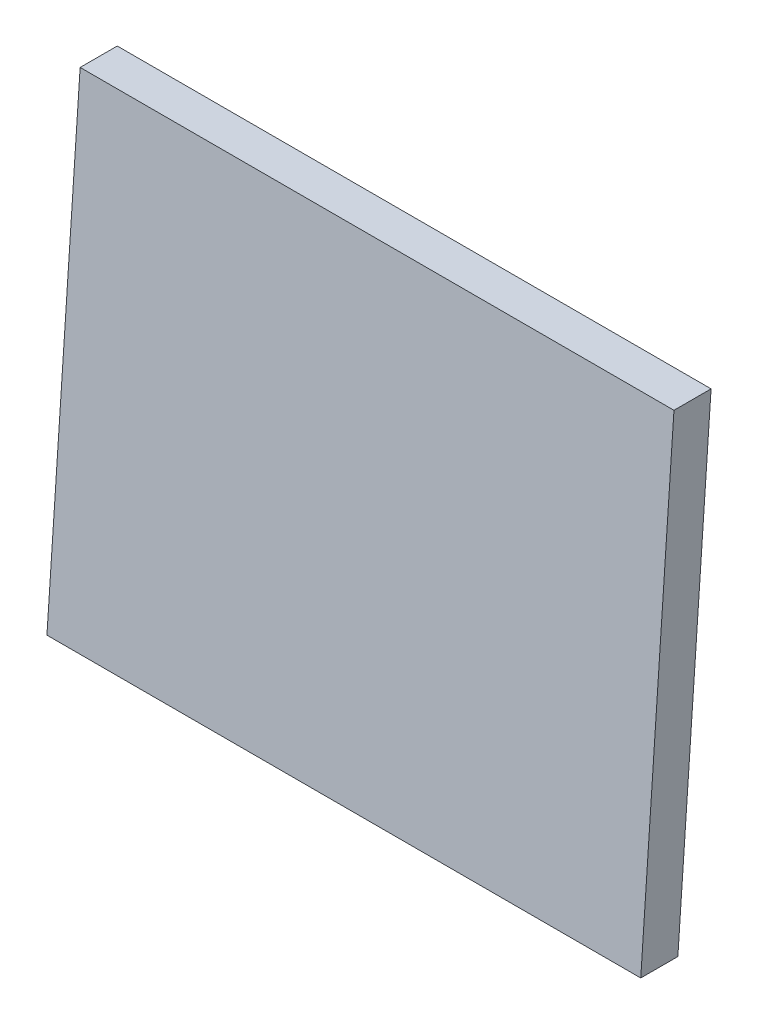
ISO-10303-21;
HEADER;
FILE_DESCRIPTION(('STEP AP214'),'2;1');
FILE_NAME('part.step','',(''),(''),'','','');
FILE_SCHEMA(('AUTOMOTIVE_DESIGN { 1 0 10303 214 1 1 1 1 }'));
ENDSEC;
DATA;
#1=APPLICATION_CONTEXT('core data for automotive mechanical design processes');
#2=APPLICATION_PROTOCOL_DEFINITION('international standard','automotive_design',2000,#1);
#3=PRODUCT_CONTEXT('',#1,'mechanical');
#4=PRODUCT('Part','Part','',(#3));
#5=PRODUCT_RELATED_PRODUCT_CATEGORY('part','',(#4));
#6=PRODUCT_DEFINITION_FORMATION('','',#4);
#7=PRODUCT_DEFINITION_CONTEXT('part definition',#1,'design');
#8=PRODUCT_DEFINITION('design','',#6,#7);
#9=PRODUCT_DEFINITION_SHAPE('','',#8);
#10=(LENGTH_UNIT() NAMED_UNIT(*) SI_UNIT(.MILLI.,.METRE.));
#11=(NAMED_UNIT(*) PLANE_ANGLE_UNIT() SI_UNIT($,.RADIAN.));
#12=(NAMED_UNIT(*) SI_UNIT($,.STERADIAN.) SOLID_ANGLE_UNIT());
#13=UNCERTAINTY_MEASURE_WITH_UNIT(LENGTH_MEASURE(1.E-05),#10,'distance_accuracy_value','');
#14=(GEOMETRIC_REPRESENTATION_CONTEXT(3) GLOBAL_UNCERTAINTY_ASSIGNED_CONTEXT((#13)) GLOBAL_UNIT_ASSIGNED_CONTEXT((#10,
#11,#12)) REPRESENTATION_CONTEXT('',''));
#15=CARTESIAN_POINT('',(0.,0.,0.));
#16=DIRECTION('',(0.,0.,1.));
#17=DIRECTION('',(1.,0.,0.));
#18=AXIS2_PLACEMENT_3D('',#15,#16,#17);
#19=CARTESIAN_POINT('',(400.,320.,-22.3765798219222));
#20=DIRECTION('',(0.,-1.,0.));
#21=DIRECTION('',(0.,0.,-1.));
#22=AXIS2_PLACEMENT_3D('',#19,#20,#21);
#23=PLANE('',#22);
#24=DIRECTION('',(0.,0.,1.));
#25=VECTOR('',#24,1.);
#26=CARTESIAN_POINT('',(0.,320.,-22.3765798219222));
#27=LINE('',#26,#25);
#28=CARTESIAN_POINT('',(0.,320.,-22.3765798219222));
#29=VERTEX_POINT('',#28);
#30=CARTESIAN_POINT('',(0.,320.,2.62342017807785));
#31=VERTEX_POINT('',#30);
#32=EDGE_CURVE('E100',#29,#31,#27,.T.);
#33=ORIENTED_EDGE('',*,*,#32,.T.);
#34=DIRECTION('',(-1.,0.,0.));
#35=VECTOR('',#34,1.);
#36=CARTESIAN_POINT('',(400.,320.,2.62342017807785));
#37=LINE('',#36,#35);
#38=CARTESIAN_POINT('',(400.,320.,2.62342017807785));
#39=VERTEX_POINT('',#38);
#40=EDGE_CURVE('E11',#39,#31,#37,.T.);
#41=ORIENTED_EDGE('',*,*,#40,.F.);
#42=DIRECTION('',(0.,0.,1.));
#43=VECTOR('',#42,1.);
#44=CARTESIAN_POINT('',(400.,320.,-22.3765798219222));
#45=LINE('',#44,#43);
#46=CARTESIAN_POINT('',(400.,320.,-22.3765798219222));
#47=VERTEX_POINT('',#46);
#48=EDGE_CURVE('E88',#47,#39,#45,.T.);
#49=ORIENTED_EDGE('',*,*,#48,.F.);
#50=DIRECTION('',(-1.,0.,0.));
#51=VECTOR('',#50,1.);
#52=CARTESIAN_POINT('',(400.,320.,-22.3765798219222));
#53=LINE('',#52,#51);
#54=EDGE_CURVE('E96',#47,#29,#53,.T.);
#55=ORIENTED_EDGE('',*,*,#54,.T.);
#56=EDGE_LOOP('',(#33,#41,#49,#55));
#57=FACE_BOUND('',#56,.T.);
#58=ADVANCED_FACE('F37',(#57),#23,.F.);
#59=CARTESIAN_POINT('',(400.,320.,2.62342017807785));
#60=DIRECTION('',(0.,-0.0697564737441289,-0.997564050259824));
#61=DIRECTION('',(0.,0.997564050259824,-0.0697564737441289));
#62=AXIS2_PLACEMENT_3D('',#59,#60,#61);
#63=PLANE('',#62);
#64=DIRECTION('',(0.,-0.997564050259824,0.0697564737441289));
#65=VECTOR('',#64,1.);
#66=CARTESIAN_POINT('',(0.,320.,2.62342017807785));
#67=LINE('',#66,#65);
#68=CARTESIAN_POINT('',(0.,0.,25.0000000000023));
#69=VERTEX_POINT('',#68);
#70=EDGE_CURVE('E92',#31,#69,#67,.T.);
#71=ORIENTED_EDGE('',*,*,#70,.T.);
#72=DIRECTION('',(-1.,0.,0.));
#73=VECTOR('',#72,1.);
#74=CARTESIAN_POINT('',(400.,0.,25.0000000000023));
#75=LINE('',#74,#73);
#76=CARTESIAN_POINT('',(400.,0.,25.0000000000023));
#77=VERTEX_POINT('',#76);
#78=EDGE_CURVE('E45',#77,#69,#75,.T.);
#79=ORIENTED_EDGE('',*,*,#78,.F.);
#80=DIRECTION('',(0.,-0.997564050259824,0.0697564737441289));
#81=VECTOR('',#80,1.);
#82=CARTESIAN_POINT('',(400.,320.,2.62342017807785));
#83=LINE('',#82,#81);
#84=EDGE_CURVE('E83',#39,#77,#83,.T.);
#85=ORIENTED_EDGE('',*,*,#84,.F.);
#86=ORIENTED_EDGE('',*,*,#40,.T.);
#87=EDGE_LOOP('',(#71,#79,#85,#86));
#88=FACE_BOUND('',#87,.T.);
#89=ADVANCED_FACE('F91',(#88),#63,.F.);
#90=CARTESIAN_POINT('',(400.,0.,25.0000000000023));
#91=DIRECTION('',(0.,1.,0.));
#92=DIRECTION('',(0.,0.,1.));
#93=AXIS2_PLACEMENT_3D('',#90,#91,#92);
#94=PLANE('',#93);
#95=DIRECTION('',(0.,0.,-1.));
#96=VECTOR('',#95,1.);
#97=CARTESIAN_POINT('',(0.,0.,25.0000000000023));
#98=LINE('',#97,#96);
#99=CARTESIAN_POINT('',(0.,0.,0.));
#100=VERTEX_POINT('',#99);
#101=EDGE_CURVE('E70',#69,#100,#98,.T.);
#102=ORIENTED_EDGE('',*,*,#101,.T.);
#103=DIRECTION('',(-1.,0.,0.));
#104=VECTOR('',#103,1.);
#105=CARTESIAN_POINT('',(400.,0.,0.));
#106=LINE('',#105,#104);
#107=CARTESIAN_POINT('',(400.,0.,0.));
#108=VERTEX_POINT('',#107);
#109=EDGE_CURVE('E93',#108,#100,#106,.T.);
#110=ORIENTED_EDGE('',*,*,#109,.F.);
#111=DIRECTION('',(0.,0.,-1.));
#112=VECTOR('',#111,1.);
#113=CARTESIAN_POINT('',(400.,0.,25.0000000000023));
#114=LINE('',#113,#112);
#115=EDGE_CURVE('E86',#77,#108,#114,.T.);
#116=ORIENTED_EDGE('',*,*,#115,.F.);
#117=ORIENTED_EDGE('',*,*,#78,.T.);
#118=EDGE_LOOP('',(#102,#110,#116,#117));
#119=FACE_BOUND('',#118,.T.);
#120=ADVANCED_FACE('F94',(#119),#94,.F.);
#121=CARTESIAN_POINT('',(400.,0.,0.));
#122=DIRECTION('',(0.,0.0697564737441217,0.997564050259825));
#123=DIRECTION('',(0.,-0.997564050259825,0.0697564737441217));
#124=AXIS2_PLACEMENT_3D('',#121,#122,#123);
#125=PLANE('',#124);
#126=DIRECTION('',(0.,0.997564050259825,-0.0697564737441217));
#127=VECTOR('',#126,1.);
#128=CARTESIAN_POINT('',(0.,0.,0.));
#129=LINE('',#128,#127);
#130=EDGE_CURVE('E76',#100,#29,#129,.T.);
#131=ORIENTED_EDGE('',*,*,#130,.T.);
#132=ORIENTED_EDGE('',*,*,#54,.F.);
#133=DIRECTION('',(0.,0.997564050259825,-0.0697564737441217));
#134=VECTOR('',#133,1.);
#135=CARTESIAN_POINT('',(400.,0.,0.));
#136=LINE('',#135,#134);
#137=EDGE_CURVE('E53',#108,#47,#136,.T.);
#138=ORIENTED_EDGE('',*,*,#137,.F.);
#139=ORIENTED_EDGE('',*,*,#109,.T.);
#140=EDGE_LOOP('',(#131,#132,#138,#139));
#141=FACE_BOUND('',#140,.T.);
#142=ADVANCED_FACE('F107',(#141),#125,.F.);
#143=CARTESIAN_POINT('',(400.,0.,0.));
#144=DIRECTION('',(1.,0.,0.));
#145=DIRECTION('',(0.,0.,-1.));
#146=AXIS2_PLACEMENT_3D('',#143,#144,#145);
#147=PLANE('',#146);
#148=ORIENTED_EDGE('',*,*,#48,.T.);
#149=ORIENTED_EDGE('',*,*,#84,.T.);
#150=ORIENTED_EDGE('',*,*,#115,.T.);
#151=ORIENTED_EDGE('',*,*,#137,.T.);
#152=EDGE_LOOP('',(#148,#149,#150,#151));
#153=FACE_BOUND('',#152,.T.);
#154=ADVANCED_FACE('F84',(#153),#147,.T.);
#155=CARTESIAN_POINT('',(0.,0.,0.));
#156=DIRECTION('',(1.,0.,0.));
#157=DIRECTION('',(0.,0.,-1.));
#158=AXIS2_PLACEMENT_3D('',#155,#156,#157);
#159=PLANE('',#158);
#160=ORIENTED_EDGE('',*,*,#32,.F.);
#161=ORIENTED_EDGE('',*,*,#130,.F.);
#162=ORIENTED_EDGE('',*,*,#101,.F.);
#163=ORIENTED_EDGE('',*,*,#70,.F.);
#164=EDGE_LOOP('',(#160,#161,#162,#163));
#165=FACE_BOUND('',#164,.T.);
#166=ADVANCED_FACE('F110',(#165),#159,.F.);
#167=CLOSED_SHELL('',(#58,#89,#120,#142,#154,#166));
#168=MANIFOLD_SOLID_BREP('B2',#167);
#169=ADVANCED_BREP_SHAPE_REPRESENTATION('',(#18,#168),#14);
#170=SHAPE_DEFINITION_REPRESENTATION(#9,#169);
ENDSEC;
END-ISO-10303-21;
